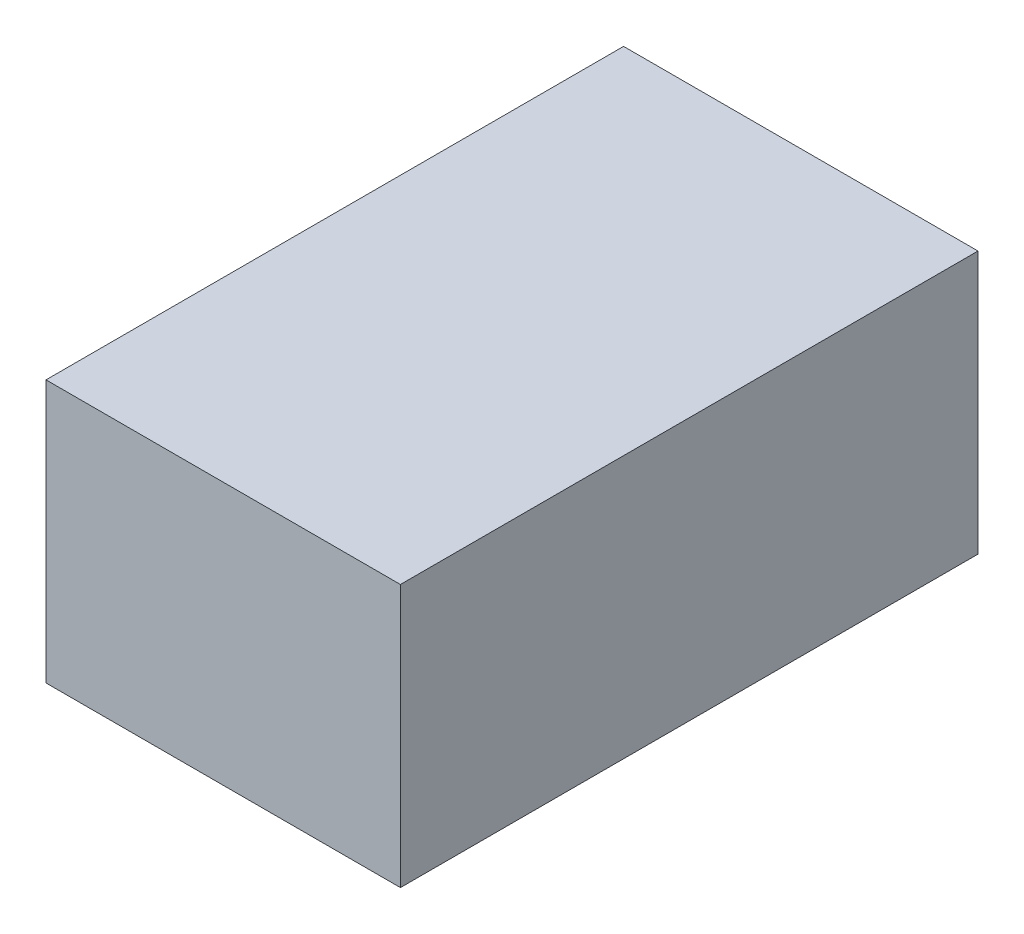
ISO-10303-21;
HEADER;
FILE_DESCRIPTION(('STEP AP214'),'2;1');
FILE_NAME('part.step','',(''),(''),'','','');
FILE_SCHEMA(('AUTOMOTIVE_DESIGN { 1 0 10303 214 1 1 1 1 }'));
ENDSEC;
DATA;
#1=APPLICATION_CONTEXT('core data for automotive mechanical design processes');
#2=APPLICATION_PROTOCOL_DEFINITION('international standard','automotive_design',2000,#1);
#3=PRODUCT_CONTEXT('',#1,'mechanical');
#4=PRODUCT('Part','Part','',(#3));
#5=PRODUCT_RELATED_PRODUCT_CATEGORY('part','',(#4));
#6=PRODUCT_DEFINITION_FORMATION('','',#4);
#7=PRODUCT_DEFINITION_CONTEXT('part definition',#1,'design');
#8=PRODUCT_DEFINITION('design','',#6,#7);
#9=PRODUCT_DEFINITION_SHAPE('','',#8);
#10=(LENGTH_UNIT() NAMED_UNIT(*) SI_UNIT(.MILLI.,.METRE.));
#11=(NAMED_UNIT(*) PLANE_ANGLE_UNIT() SI_UNIT($,.RADIAN.));
#12=(NAMED_UNIT(*) SI_UNIT($,.STERADIAN.) SOLID_ANGLE_UNIT());
#13=UNCERTAINTY_MEASURE_WITH_UNIT(LENGTH_MEASURE(1.E-05),#10,'distance_accuracy_value','');
#14=(GEOMETRIC_REPRESENTATION_CONTEXT(3) GLOBAL_UNCERTAINTY_ASSIGNED_CONTEXT((#13)) GLOBAL_UNIT_ASSIGNED_CONTEXT((#10,
#11,#12)) REPRESENTATION_CONTEXT('',''));
#15=CARTESIAN_POINT('',(0.,0.,0.));
#16=DIRECTION('',(0.,0.,1.));
#17=DIRECTION('',(1.,0.,0.));
#18=AXIS2_PLACEMENT_3D('',#15,#16,#17);
#19=CARTESIAN_POINT('',(15.675,-0.85,-47.2));
#20=DIRECTION('',(0.,1.,0.));
#21=DIRECTION('',(0.,0.,-1.));
#22=AXIS2_PLACEMENT_3D('',#19,#20,#21);
#23=PLANE('',#22);
#24=DIRECTION('',(1.,0.,0.));
#25=VECTOR('',#24,1.);
#26=CARTESIAN_POINT('',(14.325,-0.85,-51.6));
#27=LINE('',#26,#25);
#28=CARTESIAN_POINT('',(12.975,-0.85,-51.6));
#29=VERTEX_POINT('',#28);
#30=CARTESIAN_POINT('',(15.675,-0.85,-51.6));
#31=VERTEX_POINT('',#30);
#32=EDGE_CURVE('E54',#29,#31,#27,.T.);
#33=ORIENTED_EDGE('',*,*,#32,.F.);
#34=DIRECTION('',(0.,0.,-1.));
#35=VECTOR('',#34,1.);
#36=CARTESIAN_POINT('',(12.975,-0.85,-49.4));
#37=LINE('',#36,#35);
#38=CARTESIAN_POINT('',(12.975,-0.85,-47.2));
#39=VERTEX_POINT('',#38);
#40=EDGE_CURVE('E69',#39,#29,#37,.T.);
#41=ORIENTED_EDGE('',*,*,#40,.F.);
#42=DIRECTION('',(-1.,0.,0.));
#43=VECTOR('',#42,1.);
#44=CARTESIAN_POINT('',(14.325,-0.85,-47.2));
#45=LINE('',#44,#43);
#46=CARTESIAN_POINT('',(15.675,-0.85,-47.2));
#47=VERTEX_POINT('',#46);
#48=EDGE_CURVE('E21',#47,#39,#45,.T.);
#49=ORIENTED_EDGE('',*,*,#48,.F.);
#50=DIRECTION('',(0.,0.,1.));
#51=VECTOR('',#50,1.);
#52=CARTESIAN_POINT('',(15.675,-0.85,-49.4));
#53=LINE('',#52,#51);
#54=EDGE_CURVE('E59',#31,#47,#53,.T.);
#55=ORIENTED_EDGE('',*,*,#54,.F.);
#56=EDGE_LOOP('',(#33,#41,#49,#55));
#57=FACE_BOUND('',#56,.T.);
#58=ADVANCED_FACE('F17',(#57),#23,.T.);
#59=CARTESIAN_POINT('',(12.975,-2.85,-47.2));
#60=DIRECTION('',(0.,0.,1.));
#61=DIRECTION('',(1.,0.,0.));
#62=AXIS2_PLACEMENT_3D('',#59,#60,#61);
#63=PLANE('',#62);
#64=ORIENTED_EDGE('',*,*,#48,.T.);
#65=DIRECTION('',(0.,1.,0.));
#66=VECTOR('',#65,1.);
#67=CARTESIAN_POINT('',(12.975,-1.85,-47.2));
#68=LINE('',#67,#66);
#69=CARTESIAN_POINT('',(12.975,-2.85,-47.2));
#70=VERTEX_POINT('',#69);
#71=EDGE_CURVE('E80',#70,#39,#68,.T.);
#72=ORIENTED_EDGE('',*,*,#71,.F.);
#73=DIRECTION('',(1.,0.,0.));
#74=VECTOR('',#73,1.);
#75=CARTESIAN_POINT('',(14.325,-2.85,-47.2));
#76=LINE('',#75,#74);
#77=CARTESIAN_POINT('',(15.675,-2.85,-47.2));
#78=VERTEX_POINT('',#77);
#79=EDGE_CURVE('E75',#70,#78,#76,.T.);
#80=ORIENTED_EDGE('',*,*,#79,.T.);
#81=DIRECTION('',(0.,-1.,0.));
#82=VECTOR('',#81,1.);
#83=CARTESIAN_POINT('',(15.675,-1.85,-47.2));
#84=LINE('',#83,#82);
#85=EDGE_CURVE('E64',#47,#78,#84,.T.);
#86=ORIENTED_EDGE('',*,*,#85,.F.);
#87=EDGE_LOOP('',(#64,#72,#80,#86));
#88=FACE_BOUND('',#87,.T.);
#89=ADVANCED_FACE('F74',(#88),#63,.T.);
#90=CARTESIAN_POINT('',(15.675,-2.85,-47.2));
#91=DIRECTION('',(1.,0.,0.));
#92=DIRECTION('',(0.,0.,-1.));
#93=AXIS2_PLACEMENT_3D('',#90,#91,#92);
#94=PLANE('',#93);
#95=ORIENTED_EDGE('',*,*,#54,.T.);
#96=ORIENTED_EDGE('',*,*,#85,.T.);
#97=DIRECTION('',(0.,0.,-1.));
#98=VECTOR('',#97,1.);
#99=CARTESIAN_POINT('',(15.675,-2.85,-49.4));
#100=LINE('',#99,#98);
#101=CARTESIAN_POINT('',(15.675,-2.85,-51.6));
#102=VERTEX_POINT('',#101);
#103=EDGE_CURVE('E85',#78,#102,#100,.T.);
#104=ORIENTED_EDGE('',*,*,#103,.T.);
#105=DIRECTION('',(0.,-1.,0.));
#106=VECTOR('',#105,1.);
#107=CARTESIAN_POINT('',(15.675,-1.85,-51.6));
#108=LINE('',#107,#106);
#109=EDGE_CURVE('E66',#31,#102,#108,.T.);
#110=ORIENTED_EDGE('',*,*,#109,.F.);
#111=EDGE_LOOP('',(#95,#96,#104,#110));
#112=FACE_BOUND('',#111,.T.);
#113=ADVANCED_FACE('F61',(#112),#94,.T.);
#114=CARTESIAN_POINT('',(15.675,-2.85,-51.6));
#115=DIRECTION('',(0.,0.,-1.));
#116=DIRECTION('',(-1.,0.,0.));
#117=AXIS2_PLACEMENT_3D('',#114,#115,#116);
#118=PLANE('',#117);
#119=ORIENTED_EDGE('',*,*,#32,.T.);
#120=ORIENTED_EDGE('',*,*,#109,.T.);
#121=DIRECTION('',(-1.,0.,0.));
#122=VECTOR('',#121,1.);
#123=CARTESIAN_POINT('',(14.325,-2.85,-51.6));
#124=LINE('',#123,#122);
#125=CARTESIAN_POINT('',(12.975,-2.85,-51.6));
#126=VERTEX_POINT('',#125);
#127=EDGE_CURVE('E27',#102,#126,#124,.T.);
#128=ORIENTED_EDGE('',*,*,#127,.T.);
#129=DIRECTION('',(0.,-1.,0.));
#130=VECTOR('',#129,1.);
#131=CARTESIAN_POINT('',(12.975,-1.85,-51.6));
#132=LINE('',#131,#130);
#133=EDGE_CURVE('E35',#29,#126,#132,.T.);
#134=ORIENTED_EDGE('',*,*,#133,.F.);
#135=EDGE_LOOP('',(#119,#120,#128,#134));
#136=FACE_BOUND('',#135,.T.);
#137=ADVANCED_FACE('F89',(#136),#118,.T.);
#138=CARTESIAN_POINT('',(12.975,-2.85,-51.6));
#139=DIRECTION('',(-1.,0.,0.));
#140=DIRECTION('',(0.,0.,1.));
#141=AXIS2_PLACEMENT_3D('',#138,#139,#140);
#142=PLANE('',#141);
#143=ORIENTED_EDGE('',*,*,#40,.T.);
#144=ORIENTED_EDGE('',*,*,#133,.T.);
#145=DIRECTION('',(0.,0.,1.));
#146=VECTOR('',#145,1.);
#147=CARTESIAN_POINT('',(12.975,-2.85,-49.4));
#148=LINE('',#147,#146);
#149=EDGE_CURVE('E11',#126,#70,#148,.T.);
#150=ORIENTED_EDGE('',*,*,#149,.T.);
#151=ORIENTED_EDGE('',*,*,#71,.T.);
#152=EDGE_LOOP('',(#143,#144,#150,#151));
#153=FACE_BOUND('',#152,.T.);
#154=ADVANCED_FACE('F91',(#153),#142,.T.);
#155=CARTESIAN_POINT('',(15.675,-2.85,-47.2));
#156=DIRECTION('',(0.,1.,0.));
#157=DIRECTION('',(0.,0.,-1.));
#158=AXIS2_PLACEMENT_3D('',#155,#156,#157);
#159=PLANE('',#158);
#160=ORIENTED_EDGE('',*,*,#127,.F.);
#161=ORIENTED_EDGE('',*,*,#103,.F.);
#162=ORIENTED_EDGE('',*,*,#79,.F.);
#163=ORIENTED_EDGE('',*,*,#149,.F.);
#164=EDGE_LOOP('',(#160,#161,#162,#163));
#165=FACE_BOUND('',#164,.T.);
#166=ADVANCED_FACE('F19',(#165),#159,.F.);
#167=CLOSED_SHELL('',(#58,#89,#113,#137,#154,#166));
#168=MANIFOLD_SOLID_BREP('B1',#167);
#169=ADVANCED_BREP_SHAPE_REPRESENTATION('',(#18,#168),#14);
#170=SHAPE_DEFINITION_REPRESENTATION(#9,#169);
ENDSEC;
END-ISO-10303-21;
